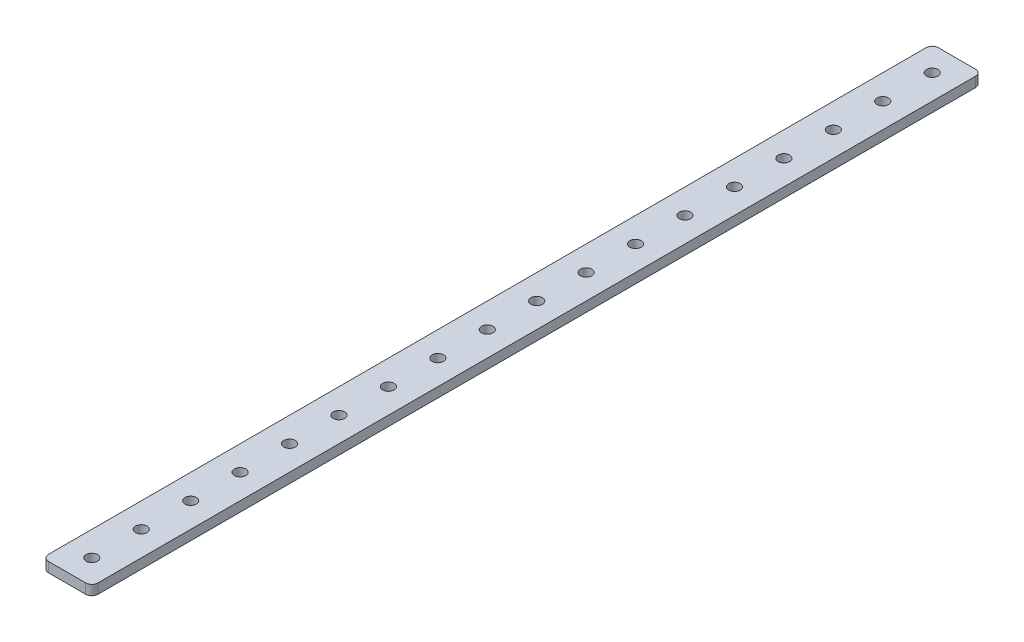
ISO-10303-21;
HEADER;
FILE_DESCRIPTION(('STEP AP214'),'2;1');
FILE_NAME('part.step','',(''),(''),'','','');
FILE_SCHEMA(('AUTOMOTIVE_DESIGN { 1 0 10303 214 1 1 1 1 }'));
ENDSEC;
DATA;
#1=APPLICATION_CONTEXT('core data for automotive mechanical design processes');
#2=APPLICATION_PROTOCOL_DEFINITION('international standard','automotive_design',2000,#1);
#3=PRODUCT_CONTEXT('',#1,'mechanical');
#4=PRODUCT('Part','Part','',(#3));
#5=PRODUCT_RELATED_PRODUCT_CATEGORY('part','',(#4));
#6=PRODUCT_DEFINITION_FORMATION('','',#4);
#7=PRODUCT_DEFINITION_CONTEXT('part definition',#1,'design');
#8=PRODUCT_DEFINITION('design','',#6,#7);
#9=PRODUCT_DEFINITION_SHAPE('','',#8);
#10=(LENGTH_UNIT() NAMED_UNIT(*) SI_UNIT(.MILLI.,.METRE.));
#11=(NAMED_UNIT(*) PLANE_ANGLE_UNIT() SI_UNIT($,.RADIAN.));
#12=(NAMED_UNIT(*) SI_UNIT($,.STERADIAN.) SOLID_ANGLE_UNIT());
#13=UNCERTAINTY_MEASURE_WITH_UNIT(LENGTH_MEASURE(1.E-05),#10,'distance_accuracy_value','');
#14=(GEOMETRIC_REPRESENTATION_CONTEXT(3) GLOBAL_UNCERTAINTY_ASSIGNED_CONTEXT((#13)) GLOBAL_UNIT_ASSIGNED_CONTEXT((#10,
#11,#12)) REPRESENTATION_CONTEXT('',''));
#15=CARTESIAN_POINT('',(0.,0.,0.));
#16=DIRECTION('',(0.,0.,1.));
#17=DIRECTION('',(1.,0.,0.));
#18=AXIS2_PLACEMENT_3D('',#15,#16,#17);
#19=CARTESIAN_POINT('',(6.,0.,-2.));
#20=DIRECTION('',(0.,1.,0.));
#21=DIRECTION('',(0.,0.,1.));
#22=AXIS2_PLACEMENT_3D('',#19,#20,#21);
#23=CYLINDRICAL_SURFACE('',#22,2.);
#24=CARTESIAN_POINT('',(6.,3.2,-2.));
#25=DIRECTION('',(0.,1.,0.));
#26=DIRECTION('',(0.,0.,1.));
#27=AXIS2_PLACEMENT_3D('',#24,#25,#26);
#28=CIRCLE('',#27,2.);
#29=CARTESIAN_POINT('',(6.,3.2,0.));
#30=VERTEX_POINT('',#29);
#31=CARTESIAN_POINT('',(8.,3.2,-2.));
#32=VERTEX_POINT('',#31);
#33=EDGE_CURVE('E129',#30,#32,#28,.T.);
#34=ORIENTED_EDGE('',*,*,#33,.F.);
#35=DIRECTION('',(0.,1.,0.));
#36=VECTOR('',#35,1.);
#37=CARTESIAN_POINT('',(6.,0.,0.));
#38=LINE('',#37,#36);
#39=CARTESIAN_POINT('',(6.,0.,0.));
#40=VERTEX_POINT('',#39);
#41=EDGE_CURVE('E11',#40,#30,#38,.T.);
#42=ORIENTED_EDGE('',*,*,#41,.F.);
#43=CARTESIAN_POINT('',(6.,0.,-2.));
#44=DIRECTION('',(0.,1.,0.));
#45=DIRECTION('',(0.,0.,1.));
#46=AXIS2_PLACEMENT_3D('',#43,#44,#45);
#47=CIRCLE('',#46,2.);
#48=CARTESIAN_POINT('',(8.,0.,-2.));
#49=VERTEX_POINT('',#48);
#50=EDGE_CURVE('E150',#40,#49,#47,.T.);
#51=ORIENTED_EDGE('',*,*,#50,.T.);
#52=DIRECTION('',(0.,1.,0.));
#53=VECTOR('',#52,1.);
#54=CARTESIAN_POINT('',(8.,0.,-2.));
#55=LINE('',#54,#53);
#56=EDGE_CURVE('E35',#49,#32,#55,.T.);
#57=ORIENTED_EDGE('',*,*,#56,.T.);
#58=EDGE_LOOP('',(#34,#42,#51,#57));
#59=FACE_BOUND('',#58,.T.);
#60=ADVANCED_FACE('F32',(#59),#23,.T.);
#61=CARTESIAN_POINT('',(-6.,0.,0.));
#62=DIRECTION('',(0.,0.,1.));
#63=DIRECTION('',(1.,0.,0.));
#64=AXIS2_PLACEMENT_3D('',#61,#62,#63);
#65=PLANE('',#64);
#66=DIRECTION('',(1.,0.,0.));
#67=VECTOR('',#66,1.);
#68=CARTESIAN_POINT('',(-6.,3.2,0.));
#69=LINE('',#68,#67);
#70=CARTESIAN_POINT('',(-6.,3.2,0.));
#71=VERTEX_POINT('',#70);
#72=EDGE_CURVE('E148',#71,#30,#69,.T.);
#73=ORIENTED_EDGE('',*,*,#72,.F.);
#74=DIRECTION('',(0.,1.,0.));
#75=VECTOR('',#74,1.);
#76=CARTESIAN_POINT('',(-6.,0.,0.));
#77=LINE('',#76,#75);
#78=CARTESIAN_POINT('',(-6.,0.,0.));
#79=VERTEX_POINT('',#78);
#80=EDGE_CURVE('E41',#79,#71,#77,.T.);
#81=ORIENTED_EDGE('',*,*,#80,.F.);
#82=DIRECTION('',(1.,0.,0.));
#83=VECTOR('',#82,1.);
#84=CARTESIAN_POINT('',(-6.,0.,0.));
#85=LINE('',#84,#83);
#86=EDGE_CURVE('E119',#79,#40,#85,.T.);
#87=ORIENTED_EDGE('',*,*,#86,.T.);
#88=ORIENTED_EDGE('',*,*,#41,.T.);
#89=EDGE_LOOP('',(#73,#81,#87,#88));
#90=FACE_BOUND('',#89,.T.);
#91=ADVANCED_FACE('F162',(#90),#65,.T.);
#92=CARTESIAN_POINT('',(-6.,0.,-2.));
#93=DIRECTION('',(0.,1.,0.));
#94=DIRECTION('',(0.,0.,1.));
#95=AXIS2_PLACEMENT_3D('',#92,#93,#94);
#96=CYLINDRICAL_SURFACE('',#95,2.);
#97=CARTESIAN_POINT('',(-6.,3.2,-2.));
#98=DIRECTION('',(0.,1.,0.));
#99=DIRECTION('',(0.,0.,1.));
#100=AXIS2_PLACEMENT_3D('',#97,#98,#99);
#101=CIRCLE('',#100,2.);
#102=CARTESIAN_POINT('',(-8.,3.2,-2.));
#103=VERTEX_POINT('',#102);
#104=EDGE_CURVE('E106',#103,#71,#101,.T.);
#105=ORIENTED_EDGE('',*,*,#104,.F.);
#106=DIRECTION('',(0.,1.,0.));
#107=VECTOR('',#106,1.);
#108=CARTESIAN_POINT('',(-8.,0.,-2.));
#109=LINE('',#108,#107);
#110=CARTESIAN_POINT('',(-8.,0.,-2.));
#111=VERTEX_POINT('',#110);
#112=EDGE_CURVE('E101',#111,#103,#109,.T.);
#113=ORIENTED_EDGE('',*,*,#112,.F.);
#114=CARTESIAN_POINT('',(-6.,0.,-2.));
#115=DIRECTION('',(0.,1.,0.));
#116=DIRECTION('',(0.,0.,1.));
#117=AXIS2_PLACEMENT_3D('',#114,#115,#116);
#118=CIRCLE('',#117,2.);
#119=EDGE_CURVE('E104',#111,#79,#118,.T.);
#120=ORIENTED_EDGE('',*,*,#119,.T.);
#121=ORIENTED_EDGE('',*,*,#80,.T.);
#122=EDGE_LOOP('',(#105,#113,#120,#121));
#123=FACE_BOUND('',#122,.T.);
#124=ADVANCED_FACE('F103',(#123),#96,.T.);
#125=CARTESIAN_POINT('',(-8.,0.,-286.));
#126=DIRECTION('',(-1.,0.,0.));
#127=DIRECTION('',(0.,0.,1.));
#128=AXIS2_PLACEMENT_3D('',#125,#126,#127);
#129=PLANE('',#128);
#130=DIRECTION('',(0.,0.,1.));
#131=VECTOR('',#130,1.);
#132=CARTESIAN_POINT('',(-8.,3.2,-286.));
#133=LINE('',#132,#131);
#134=CARTESIAN_POINT('',(-8.,3.2,-286.));
#135=VERTEX_POINT('',#134);
#136=EDGE_CURVE('E145',#135,#103,#133,.T.);
#137=ORIENTED_EDGE('',*,*,#136,.F.);
#138=DIRECTION('',(0.,1.,0.));
#139=VECTOR('',#138,1.);
#140=CARTESIAN_POINT('',(-8.,0.,-286.));
#141=LINE('',#140,#139);
#142=CARTESIAN_POINT('',(-8.,0.,-286.));
#143=VERTEX_POINT('',#142);
#144=EDGE_CURVE('E111',#143,#135,#141,.T.);
#145=ORIENTED_EDGE('',*,*,#144,.F.);
#146=DIRECTION('',(0.,0.,1.));
#147=VECTOR('',#146,1.);
#148=CARTESIAN_POINT('',(-8.,0.,-286.));
#149=LINE('',#148,#147);
#150=EDGE_CURVE('E117',#143,#111,#149,.T.);
#151=ORIENTED_EDGE('',*,*,#150,.T.);
#152=ORIENTED_EDGE('',*,*,#112,.T.);
#153=EDGE_LOOP('',(#137,#145,#151,#152));
#154=FACE_BOUND('',#153,.T.);
#155=ADVANCED_FACE('F121',(#154),#129,.T.);
#156=CARTESIAN_POINT('',(-6.,0.,-286.));
#157=DIRECTION('',(0.,1.,0.));
#158=DIRECTION('',(0.,0.,1.));
#159=AXIS2_PLACEMENT_3D('',#156,#157,#158);
#160=CYLINDRICAL_SURFACE('',#159,2.);
#161=CARTESIAN_POINT('',(-6.,3.2,-286.));
#162=DIRECTION('',(0.,1.,0.));
#163=DIRECTION('',(0.,0.,1.));
#164=AXIS2_PLACEMENT_3D('',#161,#162,#163);
#165=CIRCLE('',#164,2.);
#166=CARTESIAN_POINT('',(-6.,3.2,-288.));
#167=VERTEX_POINT('',#166);
#168=EDGE_CURVE('E142',#167,#135,#165,.T.);
#169=ORIENTED_EDGE('',*,*,#168,.F.);
#170=DIRECTION('',(0.,1.,0.));
#171=VECTOR('',#170,1.);
#172=CARTESIAN_POINT('',(-6.,0.,-288.));
#173=LINE('',#172,#171);
#174=CARTESIAN_POINT('',(-6.,0.,-288.));
#175=VERTEX_POINT('',#174);
#176=EDGE_CURVE('E154',#175,#167,#173,.T.);
#177=ORIENTED_EDGE('',*,*,#176,.F.);
#178=CARTESIAN_POINT('',(-6.,0.,-286.));
#179=DIRECTION('',(0.,1.,0.));
#180=DIRECTION('',(0.,0.,1.));
#181=AXIS2_PLACEMENT_3D('',#178,#179,#180);
#182=CIRCLE('',#181,2.);
#183=EDGE_CURVE('E122',#175,#143,#182,.T.);
#184=ORIENTED_EDGE('',*,*,#183,.T.);
#185=ORIENTED_EDGE('',*,*,#144,.T.);
#186=EDGE_LOOP('',(#169,#177,#184,#185));
#187=FACE_BOUND('',#186,.T.);
#188=ADVANCED_FACE('F175',(#187),#160,.T.);
#189=CARTESIAN_POINT('',(6.,0.,-288.));
#190=DIRECTION('',(0.,0.,-1.));
#191=DIRECTION('',(-1.,0.,0.));
#192=AXIS2_PLACEMENT_3D('',#189,#190,#191);
#193=PLANE('',#192);
#194=DIRECTION('',(-1.,0.,0.));
#195=VECTOR('',#194,1.);
#196=CARTESIAN_POINT('',(6.,3.2,-288.));
#197=LINE('',#196,#195);
#198=CARTESIAN_POINT('',(6.,3.2,-288.));
#199=VERTEX_POINT('',#198);
#200=EDGE_CURVE('E139',#199,#167,#197,.T.);
#201=ORIENTED_EDGE('',*,*,#200,.F.);
#202=DIRECTION('',(0.,1.,0.));
#203=VECTOR('',#202,1.);
#204=CARTESIAN_POINT('',(6.,0.,-288.));
#205=LINE('',#204,#203);
#206=CARTESIAN_POINT('',(6.,0.,-288.));
#207=VERTEX_POINT('',#206);
#208=EDGE_CURVE('E156',#207,#199,#205,.T.);
#209=ORIENTED_EDGE('',*,*,#208,.F.);
#210=DIRECTION('',(-1.,0.,0.));
#211=VECTOR('',#210,1.);
#212=CARTESIAN_POINT('',(6.,0.,-288.));
#213=LINE('',#212,#211);
#214=EDGE_CURVE('E124',#207,#175,#213,.T.);
#215=ORIENTED_EDGE('',*,*,#214,.T.);
#216=ORIENTED_EDGE('',*,*,#176,.T.);
#217=EDGE_LOOP('',(#201,#209,#215,#216));
#218=FACE_BOUND('',#217,.T.);
#219=ADVANCED_FACE('F178',(#218),#193,.T.);
#220=CARTESIAN_POINT('',(6.,0.,-286.));
#221=DIRECTION('',(0.,1.,0.));
#222=DIRECTION('',(0.,0.,1.));
#223=AXIS2_PLACEMENT_3D('',#220,#221,#222);
#224=CYLINDRICAL_SURFACE('',#223,2.);
#225=CARTESIAN_POINT('',(6.,3.2,-286.));
#226=DIRECTION('',(0.,1.,0.));
#227=DIRECTION('',(0.,0.,1.));
#228=AXIS2_PLACEMENT_3D('',#225,#226,#227);
#229=CIRCLE('',#228,2.);
#230=CARTESIAN_POINT('',(8.,3.2,-286.));
#231=VERTEX_POINT('',#230);
#232=EDGE_CURVE('E136',#231,#199,#229,.T.);
#233=ORIENTED_EDGE('',*,*,#232,.F.);
#234=DIRECTION('',(0.,1.,0.));
#235=VECTOR('',#234,1.);
#236=CARTESIAN_POINT('',(8.,0.,-286.));
#237=LINE('',#236,#235);
#238=CARTESIAN_POINT('',(8.,0.,-286.));
#239=VERTEX_POINT('',#238);
#240=EDGE_CURVE('E157',#239,#231,#237,.T.);
#241=ORIENTED_EDGE('',*,*,#240,.F.);
#242=CARTESIAN_POINT('',(6.,0.,-286.));
#243=DIRECTION('',(0.,1.,0.));
#244=DIRECTION('',(0.,0.,1.));
#245=AXIS2_PLACEMENT_3D('',#242,#243,#244);
#246=CIRCLE('',#245,2.);
#247=EDGE_CURVE('E384',#239,#207,#246,.T.);
#248=ORIENTED_EDGE('',*,*,#247,.T.);
#249=ORIENTED_EDGE('',*,*,#208,.T.);
#250=EDGE_LOOP('',(#233,#241,#248,#249));
#251=FACE_BOUND('',#250,.T.);
#252=ADVANCED_FACE('F182',(#251),#224,.T.);
#253=CARTESIAN_POINT('',(8.,0.,-2.));
#254=DIRECTION('',(1.,0.,0.));
#255=DIRECTION('',(0.,0.,-1.));
#256=AXIS2_PLACEMENT_3D('',#253,#254,#255);
#257=PLANE('',#256);
#258=DIRECTION('',(0.,0.,-1.));
#259=VECTOR('',#258,1.);
#260=CARTESIAN_POINT('',(8.,3.2,-2.));
#261=LINE('',#260,#259);
#262=EDGE_CURVE('E132',#32,#231,#261,.T.);
#263=ORIENTED_EDGE('',*,*,#262,.F.);
#264=ORIENTED_EDGE('',*,*,#56,.F.);
#265=DIRECTION('',(0.,0.,-1.));
#266=VECTOR('',#265,1.);
#267=CARTESIAN_POINT('',(8.,0.,-2.));
#268=LINE('',#267,#266);
#269=EDGE_CURVE('E382',#49,#239,#268,.T.);
#270=ORIENTED_EDGE('',*,*,#269,.T.);
#271=ORIENTED_EDGE('',*,*,#240,.T.);
#272=EDGE_LOOP('',(#263,#264,#270,#271));
#273=FACE_BOUND('',#272,.T.);
#274=ADVANCED_FACE('F159',(#273),#257,.T.);
#275=CARTESIAN_POINT('',(6.,0.,-2.));
#276=DIRECTION('',(0.,1.,0.));
#277=DIRECTION('',(0.,0.,1.));
#278=AXIS2_PLACEMENT_3D('',#275,#276,#277);
#279=PLANE('',#278);
#280=CARTESIAN_POINT('',(0.,0.,-8.));
#281=DIRECTION('',(0.,1.,0.));
#282=DIRECTION('',(0.,0.,-1.));
#283=AXIS2_PLACEMENT_3D('',#280,#281,#282);
#284=CIRCLE('',#283,1.85);
#285=CARTESIAN_POINT('',(0.,0.,-9.85));
#286=VERTEX_POINT('',#285);
#287=EDGE_CURVE('E273',#286,#286,#284,.T.);
#288=ORIENTED_EDGE('',*,*,#287,.T.);
#289=EDGE_LOOP('',(#288));
#290=FACE_BOUND('',#289,.T.);
#291=CARTESIAN_POINT('',(0.,0.,-24.));
#292=DIRECTION('',(0.,1.,0.));
#293=DIRECTION('',(0.,0.,-1.));
#294=AXIS2_PLACEMENT_3D('',#291,#292,#293);
#295=CIRCLE('',#294,1.85);
#296=CARTESIAN_POINT('',(0.,0.,-25.85));
#297=VERTEX_POINT('',#296);
#298=EDGE_CURVE('E281',#297,#297,#295,.T.);
#299=ORIENTED_EDGE('',*,*,#298,.T.);
#300=EDGE_LOOP('',(#299));
#301=FACE_BOUND('',#300,.T.);
#302=CARTESIAN_POINT('',(0.,0.,-40.));
#303=DIRECTION('',(0.,1.,0.));
#304=DIRECTION('',(0.,0.,-1.));
#305=AXIS2_PLACEMENT_3D('',#302,#303,#304);
#306=CIRCLE('',#305,1.85);
#307=CARTESIAN_POINT('',(0.,0.,-41.85));
#308=VERTEX_POINT('',#307);
#309=EDGE_CURVE('E287',#308,#308,#306,.T.);
#310=ORIENTED_EDGE('',*,*,#309,.T.);
#311=EDGE_LOOP('',(#310));
#312=FACE_BOUND('',#311,.T.);
#313=CARTESIAN_POINT('',(0.,0.,-56.));
#314=DIRECTION('',(0.,1.,0.));
#315=DIRECTION('',(0.,0.,-1.));
#316=AXIS2_PLACEMENT_3D('',#313,#314,#315);
#317=CIRCLE('',#316,1.85);
#318=CARTESIAN_POINT('',(0.,0.,-57.85));
#319=VERTEX_POINT('',#318);
#320=EDGE_CURVE('E293',#319,#319,#317,.T.);
#321=ORIENTED_EDGE('',*,*,#320,.T.);
#322=EDGE_LOOP('',(#321));
#323=FACE_BOUND('',#322,.T.);
#324=CARTESIAN_POINT('',(0.,0.,-72.));
#325=DIRECTION('',(0.,1.,0.));
#326=DIRECTION('',(0.,0.,-1.));
#327=AXIS2_PLACEMENT_3D('',#324,#325,#326);
#328=CIRCLE('',#327,1.85);
#329=CARTESIAN_POINT('',(0.,0.,-73.85));
#330=VERTEX_POINT('',#329);
#331=EDGE_CURVE('E299',#330,#330,#328,.T.);
#332=ORIENTED_EDGE('',*,*,#331,.T.);
#333=EDGE_LOOP('',(#332));
#334=FACE_BOUND('',#333,.T.);
#335=CARTESIAN_POINT('',(0.,0.,-88.));
#336=DIRECTION('',(0.,1.,0.));
#337=DIRECTION('',(0.,0.,-1.));
#338=AXIS2_PLACEMENT_3D('',#335,#336,#337);
#339=CIRCLE('',#338,1.85);
#340=CARTESIAN_POINT('',(0.,0.,-89.85));
#341=VERTEX_POINT('',#340);
#342=EDGE_CURVE('E305',#341,#341,#339,.T.);
#343=ORIENTED_EDGE('',*,*,#342,.T.);
#344=EDGE_LOOP('',(#343));
#345=FACE_BOUND('',#344,.T.);
#346=CARTESIAN_POINT('',(0.,0.,-104.));
#347=DIRECTION('',(0.,1.,0.));
#348=DIRECTION('',(0.,0.,-1.));
#349=AXIS2_PLACEMENT_3D('',#346,#347,#348);
#350=CIRCLE('',#349,1.85);
#351=CARTESIAN_POINT('',(0.,0.,-105.85));
#352=VERTEX_POINT('',#351);
#353=EDGE_CURVE('E311',#352,#352,#350,.T.);
#354=ORIENTED_EDGE('',*,*,#353,.T.);
#355=EDGE_LOOP('',(#354));
#356=FACE_BOUND('',#355,.T.);
#357=CARTESIAN_POINT('',(0.,0.,-120.));
#358=DIRECTION('',(0.,1.,0.));
#359=DIRECTION('',(0.,0.,-1.));
#360=AXIS2_PLACEMENT_3D('',#357,#358,#359);
#361=CIRCLE('',#360,1.85);
#362=CARTESIAN_POINT('',(0.,0.,-121.85));
#363=VERTEX_POINT('',#362);
#364=EDGE_CURVE('E317',#363,#363,#361,.T.);
#365=ORIENTED_EDGE('',*,*,#364,.T.);
#366=EDGE_LOOP('',(#365));
#367=FACE_BOUND('',#366,.T.);
#368=CARTESIAN_POINT('',(0.,0.,-136.));
#369=DIRECTION('',(0.,1.,0.));
#370=DIRECTION('',(0.,0.,-1.));
#371=AXIS2_PLACEMENT_3D('',#368,#369,#370);
#372=CIRCLE('',#371,1.84999999999999);
#373=CARTESIAN_POINT('',(0.,0.,-137.85));
#374=VERTEX_POINT('',#373);
#375=EDGE_CURVE('E323',#374,#374,#372,.T.);
#376=ORIENTED_EDGE('',*,*,#375,.T.);
#377=EDGE_LOOP('',(#376));
#378=FACE_BOUND('',#377,.T.);
#379=CARTESIAN_POINT('',(0.,0.,-152.));
#380=DIRECTION('',(0.,1.,0.));
#381=DIRECTION('',(0.,0.,-1.));
#382=AXIS2_PLACEMENT_3D('',#379,#380,#381);
#383=CIRCLE('',#382,1.84999999999999);
#384=CARTESIAN_POINT('',(0.,0.,-153.85));
#385=VERTEX_POINT('',#384);
#386=EDGE_CURVE('E329',#385,#385,#383,.T.);
#387=ORIENTED_EDGE('',*,*,#386,.T.);
#388=EDGE_LOOP('',(#387));
#389=FACE_BOUND('',#388,.T.);
#390=CARTESIAN_POINT('',(0.,0.,-168.));
#391=DIRECTION('',(0.,1.,0.));
#392=DIRECTION('',(0.,0.,-1.));
#393=AXIS2_PLACEMENT_3D('',#390,#391,#392);
#394=CIRCLE('',#393,1.84999999999999);
#395=CARTESIAN_POINT('',(0.,0.,-169.85));
#396=VERTEX_POINT('',#395);
#397=EDGE_CURVE('E335',#396,#396,#394,.T.);
#398=ORIENTED_EDGE('',*,*,#397,.T.);
#399=EDGE_LOOP('',(#398));
#400=FACE_BOUND('',#399,.T.);
#401=CARTESIAN_POINT('',(0.,0.,-184.));
#402=DIRECTION('',(0.,1.,0.));
#403=DIRECTION('',(0.,0.,-1.));
#404=AXIS2_PLACEMENT_3D('',#401,#402,#403);
#405=CIRCLE('',#404,1.84999999999999);
#406=CARTESIAN_POINT('',(0.,0.,-185.85));
#407=VERTEX_POINT('',#406);
#408=EDGE_CURVE('E341',#407,#407,#405,.T.);
#409=ORIENTED_EDGE('',*,*,#408,.T.);
#410=EDGE_LOOP('',(#409));
#411=FACE_BOUND('',#410,.T.);
#412=CARTESIAN_POINT('',(0.,0.,-200.));
#413=DIRECTION('',(0.,1.,0.));
#414=DIRECTION('',(0.,0.,-1.));
#415=AXIS2_PLACEMENT_3D('',#412,#413,#414);
#416=CIRCLE('',#415,1.84999999999999);
#417=CARTESIAN_POINT('',(0.,0.,-201.85));
#418=VERTEX_POINT('',#417);
#419=EDGE_CURVE('E347',#418,#418,#416,.T.);
#420=ORIENTED_EDGE('',*,*,#419,.T.);
#421=EDGE_LOOP('',(#420));
#422=FACE_BOUND('',#421,.T.);
#423=CARTESIAN_POINT('',(0.,0.,-216.));
#424=DIRECTION('',(0.,1.,0.));
#425=DIRECTION('',(0.,0.,-1.));
#426=AXIS2_PLACEMENT_3D('',#423,#424,#425);
#427=CIRCLE('',#426,1.84999999999999);
#428=CARTESIAN_POINT('',(0.,0.,-217.85));
#429=VERTEX_POINT('',#428);
#430=EDGE_CURVE('E353',#429,#429,#427,.T.);
#431=ORIENTED_EDGE('',*,*,#430,.T.);
#432=EDGE_LOOP('',(#431));
#433=FACE_BOUND('',#432,.T.);
#434=CARTESIAN_POINT('',(0.,0.,-232.));
#435=DIRECTION('',(0.,1.,0.));
#436=DIRECTION('',(0.,0.,-1.));
#437=AXIS2_PLACEMENT_3D('',#434,#435,#436);
#438=CIRCLE('',#437,1.84999999999999);
#439=CARTESIAN_POINT('',(0.,0.,-233.85));
#440=VERTEX_POINT('',#439);
#441=EDGE_CURVE('E359',#440,#440,#438,.T.);
#442=ORIENTED_EDGE('',*,*,#441,.T.);
#443=EDGE_LOOP('',(#442));
#444=FACE_BOUND('',#443,.T.);
#445=CARTESIAN_POINT('',(0.,0.,-248.));
#446=DIRECTION('',(0.,1.,0.));
#447=DIRECTION('',(0.,0.,-1.));
#448=AXIS2_PLACEMENT_3D('',#445,#446,#447);
#449=CIRCLE('',#448,1.84999999999999);
#450=CARTESIAN_POINT('',(0.,0.,-249.85));
#451=VERTEX_POINT('',#450);
#452=EDGE_CURVE('E365',#451,#451,#449,.T.);
#453=ORIENTED_EDGE('',*,*,#452,.T.);
#454=EDGE_LOOP('',(#453));
#455=FACE_BOUND('',#454,.T.);
#456=CARTESIAN_POINT('',(0.,0.,-264.));
#457=DIRECTION('',(0.,1.,0.));
#458=DIRECTION('',(0.,0.,-1.));
#459=AXIS2_PLACEMENT_3D('',#456,#457,#458);
#460=CIRCLE('',#459,1.85000000000002);
#461=CARTESIAN_POINT('',(0.,0.,-265.85));
#462=VERTEX_POINT('',#461);
#463=EDGE_CURVE('E371',#462,#462,#460,.T.);
#464=ORIENTED_EDGE('',*,*,#463,.T.);
#465=EDGE_LOOP('',(#464));
#466=FACE_BOUND('',#465,.T.);
#467=CARTESIAN_POINT('',(0.,0.,-280.));
#468=DIRECTION('',(0.,1.,0.));
#469=DIRECTION('',(0.,0.,-1.));
#470=AXIS2_PLACEMENT_3D('',#467,#468,#469);
#471=CIRCLE('',#470,1.85000000000002);
#472=CARTESIAN_POINT('',(0.,0.,-281.85));
#473=VERTEX_POINT('',#472);
#474=EDGE_CURVE('E133',#473,#473,#471,.T.);
#475=ORIENTED_EDGE('',*,*,#474,.T.);
#476=EDGE_LOOP('',(#475));
#477=FACE_BOUND('',#476,.T.);
#478=ORIENTED_EDGE('',*,*,#50,.F.);
#479=ORIENTED_EDGE('',*,*,#86,.F.);
#480=ORIENTED_EDGE('',*,*,#119,.F.);
#481=ORIENTED_EDGE('',*,*,#150,.F.);
#482=ORIENTED_EDGE('',*,*,#183,.F.);
#483=ORIENTED_EDGE('',*,*,#214,.F.);
#484=ORIENTED_EDGE('',*,*,#247,.F.);
#485=ORIENTED_EDGE('',*,*,#269,.F.);
#486=EDGE_LOOP('',(#478,#479,#480,#481,#482,#483,#484,#485));
#487=FACE_BOUND('',#486,.T.);
#488=ADVANCED_FACE('F115',(#290,#301,#312,#323,#334,#345,#356,#367,#378,#389,#400,#411,#422,
#433,#444,#455,#466,#477,#487),#279,.F.);
#489=CARTESIAN_POINT('',(6.,3.2,-2.));
#490=DIRECTION('',(0.,1.,0.));
#491=DIRECTION('',(0.,0.,1.));
#492=AXIS2_PLACEMENT_3D('',#489,#490,#491);
#493=PLANE('',#492);
#494=CARTESIAN_POINT('',(0.,3.2,-8.));
#495=DIRECTION('',(0.,1.,0.));
#496=DIRECTION('',(0.,0.,-1.));
#497=AXIS2_PLACEMENT_3D('',#494,#495,#496);
#498=CIRCLE('',#497,1.85);
#499=CARTESIAN_POINT('',(0.,3.2,-9.85));
#500=VERTEX_POINT('',#499);
#501=EDGE_CURVE('E276',#500,#500,#498,.T.);
#502=ORIENTED_EDGE('',*,*,#501,.F.);
#503=EDGE_LOOP('',(#502));
#504=FACE_BOUND('',#503,.T.);
#505=CARTESIAN_POINT('',(0.,3.2,-24.));
#506=DIRECTION('',(0.,1.,0.));
#507=DIRECTION('',(0.,0.,-1.));
#508=AXIS2_PLACEMENT_3D('',#505,#506,#507);
#509=CIRCLE('',#508,1.85);
#510=CARTESIAN_POINT('',(0.,3.2,-25.85));
#511=VERTEX_POINT('',#510);
#512=EDGE_CURVE('E278',#511,#511,#509,.T.);
#513=ORIENTED_EDGE('',*,*,#512,.F.);
#514=EDGE_LOOP('',(#513));
#515=FACE_BOUND('',#514,.T.);
#516=CARTESIAN_POINT('',(0.,3.2,-40.));
#517=DIRECTION('',(0.,1.,0.));
#518=DIRECTION('',(0.,0.,-1.));
#519=AXIS2_PLACEMENT_3D('',#516,#517,#518);
#520=CIRCLE('',#519,1.85);
#521=CARTESIAN_POINT('',(0.,3.2,-41.85));
#522=VERTEX_POINT('',#521);
#523=EDGE_CURVE('E284',#522,#522,#520,.T.);
#524=ORIENTED_EDGE('',*,*,#523,.F.);
#525=EDGE_LOOP('',(#524));
#526=FACE_BOUND('',#525,.T.);
#527=CARTESIAN_POINT('',(0.,3.2,-56.));
#528=DIRECTION('',(0.,1.,0.));
#529=DIRECTION('',(0.,0.,-1.));
#530=AXIS2_PLACEMENT_3D('',#527,#528,#529);
#531=CIRCLE('',#530,1.85);
#532=CARTESIAN_POINT('',(0.,3.2,-57.85));
#533=VERTEX_POINT('',#532);
#534=EDGE_CURVE('E290',#533,#533,#531,.T.);
#535=ORIENTED_EDGE('',*,*,#534,.F.);
#536=EDGE_LOOP('',(#535));
#537=FACE_BOUND('',#536,.T.);
#538=CARTESIAN_POINT('',(0.,3.2,-72.));
#539=DIRECTION('',(0.,1.,0.));
#540=DIRECTION('',(0.,0.,-1.));
#541=AXIS2_PLACEMENT_3D('',#538,#539,#540);
#542=CIRCLE('',#541,1.85);
#543=CARTESIAN_POINT('',(0.,3.2,-73.85));
#544=VERTEX_POINT('',#543);
#545=EDGE_CURVE('E296',#544,#544,#542,.T.);
#546=ORIENTED_EDGE('',*,*,#545,.F.);
#547=EDGE_LOOP('',(#546));
#548=FACE_BOUND('',#547,.T.);
#549=CARTESIAN_POINT('',(0.,3.2,-88.));
#550=DIRECTION('',(0.,1.,0.));
#551=DIRECTION('',(0.,0.,-1.));
#552=AXIS2_PLACEMENT_3D('',#549,#550,#551);
#553=CIRCLE('',#552,1.85);
#554=CARTESIAN_POINT('',(0.,3.2,-89.85));
#555=VERTEX_POINT('',#554);
#556=EDGE_CURVE('E302',#555,#555,#553,.T.);
#557=ORIENTED_EDGE('',*,*,#556,.F.);
#558=EDGE_LOOP('',(#557));
#559=FACE_BOUND('',#558,.T.);
#560=CARTESIAN_POINT('',(0.,3.2,-104.));
#561=DIRECTION('',(0.,1.,0.));
#562=DIRECTION('',(0.,0.,-1.));
#563=AXIS2_PLACEMENT_3D('',#560,#561,#562);
#564=CIRCLE('',#563,1.85);
#565=CARTESIAN_POINT('',(0.,3.2,-105.85));
#566=VERTEX_POINT('',#565);
#567=EDGE_CURVE('E308',#566,#566,#564,.T.);
#568=ORIENTED_EDGE('',*,*,#567,.F.);
#569=EDGE_LOOP('',(#568));
#570=FACE_BOUND('',#569,.T.);
#571=CARTESIAN_POINT('',(0.,3.2,-120.));
#572=DIRECTION('',(0.,1.,0.));
#573=DIRECTION('',(0.,0.,-1.));
#574=AXIS2_PLACEMENT_3D('',#571,#572,#573);
#575=CIRCLE('',#574,1.85);
#576=CARTESIAN_POINT('',(0.,3.2,-121.85));
#577=VERTEX_POINT('',#576);
#578=EDGE_CURVE('E314',#577,#577,#575,.T.);
#579=ORIENTED_EDGE('',*,*,#578,.F.);
#580=EDGE_LOOP('',(#579));
#581=FACE_BOUND('',#580,.T.);
#582=CARTESIAN_POINT('',(0.,3.2,-136.));
#583=DIRECTION('',(0.,1.,0.));
#584=DIRECTION('',(0.,0.,-1.));
#585=AXIS2_PLACEMENT_3D('',#582,#583,#584);
#586=CIRCLE('',#585,1.84999999999999);
#587=CARTESIAN_POINT('',(0.,3.2,-137.85));
#588=VERTEX_POINT('',#587);
#589=EDGE_CURVE('E320',#588,#588,#586,.T.);
#590=ORIENTED_EDGE('',*,*,#589,.F.);
#591=EDGE_LOOP('',(#590));
#592=FACE_BOUND('',#591,.T.);
#593=CARTESIAN_POINT('',(0.,3.2,-152.));
#594=DIRECTION('',(0.,1.,0.));
#595=DIRECTION('',(0.,0.,-1.));
#596=AXIS2_PLACEMENT_3D('',#593,#594,#595);
#597=CIRCLE('',#596,1.84999999999999);
#598=CARTESIAN_POINT('',(0.,3.2,-153.85));
#599=VERTEX_POINT('',#598);
#600=EDGE_CURVE('E326',#599,#599,#597,.T.);
#601=ORIENTED_EDGE('',*,*,#600,.F.);
#602=EDGE_LOOP('',(#601));
#603=FACE_BOUND('',#602,.T.);
#604=CARTESIAN_POINT('',(0.,3.2,-168.));
#605=DIRECTION('',(0.,1.,0.));
#606=DIRECTION('',(0.,0.,-1.));
#607=AXIS2_PLACEMENT_3D('',#604,#605,#606);
#608=CIRCLE('',#607,1.84999999999999);
#609=CARTESIAN_POINT('',(0.,3.2,-169.85));
#610=VERTEX_POINT('',#609);
#611=EDGE_CURVE('E332',#610,#610,#608,.T.);
#612=ORIENTED_EDGE('',*,*,#611,.F.);
#613=EDGE_LOOP('',(#612));
#614=FACE_BOUND('',#613,.T.);
#615=CARTESIAN_POINT('',(0.,3.2,-184.));
#616=DIRECTION('',(0.,1.,0.));
#617=DIRECTION('',(0.,0.,-1.));
#618=AXIS2_PLACEMENT_3D('',#615,#616,#617);
#619=CIRCLE('',#618,1.84999999999999);
#620=CARTESIAN_POINT('',(0.,3.2,-185.85));
#621=VERTEX_POINT('',#620);
#622=EDGE_CURVE('E338',#621,#621,#619,.T.);
#623=ORIENTED_EDGE('',*,*,#622,.F.);
#624=EDGE_LOOP('',(#623));
#625=FACE_BOUND('',#624,.T.);
#626=CARTESIAN_POINT('',(0.,3.2,-200.));
#627=DIRECTION('',(0.,1.,0.));
#628=DIRECTION('',(0.,0.,-1.));
#629=AXIS2_PLACEMENT_3D('',#626,#627,#628);
#630=CIRCLE('',#629,1.84999999999999);
#631=CARTESIAN_POINT('',(0.,3.2,-201.85));
#632=VERTEX_POINT('',#631);
#633=EDGE_CURVE('E344',#632,#632,#630,.T.);
#634=ORIENTED_EDGE('',*,*,#633,.F.);
#635=EDGE_LOOP('',(#634));
#636=FACE_BOUND('',#635,.T.);
#637=CARTESIAN_POINT('',(0.,3.2,-216.));
#638=DIRECTION('',(0.,1.,0.));
#639=DIRECTION('',(0.,0.,-1.));
#640=AXIS2_PLACEMENT_3D('',#637,#638,#639);
#641=CIRCLE('',#640,1.84999999999999);
#642=CARTESIAN_POINT('',(0.,3.2,-217.85));
#643=VERTEX_POINT('',#642);
#644=EDGE_CURVE('E350',#643,#643,#641,.T.);
#645=ORIENTED_EDGE('',*,*,#644,.F.);
#646=EDGE_LOOP('',(#645));
#647=FACE_BOUND('',#646,.T.);
#648=CARTESIAN_POINT('',(0.,3.2,-232.));
#649=DIRECTION('',(0.,1.,0.));
#650=DIRECTION('',(0.,0.,-1.));
#651=AXIS2_PLACEMENT_3D('',#648,#649,#650);
#652=CIRCLE('',#651,1.84999999999999);
#653=CARTESIAN_POINT('',(0.,3.2,-233.85));
#654=VERTEX_POINT('',#653);
#655=EDGE_CURVE('E356',#654,#654,#652,.T.);
#656=ORIENTED_EDGE('',*,*,#655,.F.);
#657=EDGE_LOOP('',(#656));
#658=FACE_BOUND('',#657,.T.);
#659=CARTESIAN_POINT('',(0.,3.2,-248.));
#660=DIRECTION('',(0.,1.,0.));
#661=DIRECTION('',(0.,0.,-1.));
#662=AXIS2_PLACEMENT_3D('',#659,#660,#661);
#663=CIRCLE('',#662,1.84999999999999);
#664=CARTESIAN_POINT('',(0.,3.2,-249.85));
#665=VERTEX_POINT('',#664);
#666=EDGE_CURVE('E362',#665,#665,#663,.T.);
#667=ORIENTED_EDGE('',*,*,#666,.F.);
#668=EDGE_LOOP('',(#667));
#669=FACE_BOUND('',#668,.T.);
#670=CARTESIAN_POINT('',(0.,3.2,-264.));
#671=DIRECTION('',(0.,1.,0.));
#672=DIRECTION('',(0.,0.,-1.));
#673=AXIS2_PLACEMENT_3D('',#670,#671,#672);
#674=CIRCLE('',#673,1.85000000000002);
#675=CARTESIAN_POINT('',(0.,3.2,-265.85));
#676=VERTEX_POINT('',#675);
#677=EDGE_CURVE('E368',#676,#676,#674,.T.);
#678=ORIENTED_EDGE('',*,*,#677,.F.);
#679=EDGE_LOOP('',(#678));
#680=FACE_BOUND('',#679,.T.);
#681=CARTESIAN_POINT('',(0.,3.2,-280.));
#682=DIRECTION('',(0.,1.,0.));
#683=DIRECTION('',(0.,0.,-1.));
#684=AXIS2_PLACEMENT_3D('',#681,#682,#683);
#685=CIRCLE('',#684,1.85000000000002);
#686=CARTESIAN_POINT('',(0.,3.2,-281.85));
#687=VERTEX_POINT('',#686);
#688=EDGE_CURVE('E374',#687,#687,#685,.T.);
#689=ORIENTED_EDGE('',*,*,#688,.F.);
#690=EDGE_LOOP('',(#689));
#691=FACE_BOUND('',#690,.T.);
#692=ORIENTED_EDGE('',*,*,#33,.T.);
#693=ORIENTED_EDGE('',*,*,#262,.T.);
#694=ORIENTED_EDGE('',*,*,#232,.T.);
#695=ORIENTED_EDGE('',*,*,#200,.T.);
#696=ORIENTED_EDGE('',*,*,#168,.T.);
#697=ORIENTED_EDGE('',*,*,#136,.T.);
#698=ORIENTED_EDGE('',*,*,#104,.T.);
#699=ORIENTED_EDGE('',*,*,#72,.T.);
#700=EDGE_LOOP('',(#692,#693,#694,#695,#696,#697,#698,#699));
#701=FACE_BOUND('',#700,.T.);
#702=ADVANCED_FACE('F161',(#504,#515,#526,#537,#548,#559,#570,#581,#592,#603,#614,#625,#636,
#647,#658,#669,#680,#691,#701),#493,.T.);
#703=CARTESIAN_POINT('',(0.,0.,-280.));
#704=DIRECTION('',(0.,1.,0.));
#705=DIRECTION('',(0.,0.,1.));
#706=AXIS2_PLACEMENT_3D('',#703,#704,#705);
#707=CYLINDRICAL_SURFACE('',#706,1.85000000000002);
#708=ORIENTED_EDGE('',*,*,#474,.F.);
#709=EDGE_LOOP('',(#708));
#710=FACE_BOUND('',#709,.T.);
#711=ORIENTED_EDGE('',*,*,#688,.T.);
#712=EDGE_LOOP('',(#711));
#713=FACE_BOUND('',#712,.T.);
#714=ADVANCED_FACE('F194',(#710,#713),#707,.F.);
#715=CARTESIAN_POINT('',(0.,0.,-264.));
#716=DIRECTION('',(0.,1.,0.));
#717=DIRECTION('',(0.,0.,1.));
#718=AXIS2_PLACEMENT_3D('',#715,#716,#717);
#719=CYLINDRICAL_SURFACE('',#718,1.85000000000002);
#720=ORIENTED_EDGE('',*,*,#463,.F.);
#721=EDGE_LOOP('',(#720));
#722=FACE_BOUND('',#721,.T.);
#723=ORIENTED_EDGE('',*,*,#677,.T.);
#724=EDGE_LOOP('',(#723));
#725=FACE_BOUND('',#724,.T.);
#726=ADVANCED_FACE('F201',(#722,#725),#719,.F.);
#727=CARTESIAN_POINT('',(0.,0.,-248.));
#728=DIRECTION('',(0.,1.,0.));
#729=DIRECTION('',(0.,0.,1.));
#730=AXIS2_PLACEMENT_3D('',#727,#728,#729);
#731=CYLINDRICAL_SURFACE('',#730,1.84999999999999);
#732=ORIENTED_EDGE('',*,*,#452,.F.);
#733=EDGE_LOOP('',(#732));
#734=FACE_BOUND('',#733,.T.);
#735=ORIENTED_EDGE('',*,*,#666,.T.);
#736=EDGE_LOOP('',(#735));
#737=FACE_BOUND('',#736,.T.);
#738=ADVANCED_FACE('F205',(#734,#737),#731,.F.);
#739=CARTESIAN_POINT('',(0.,0.,-232.));
#740=DIRECTION('',(0.,1.,0.));
#741=DIRECTION('',(0.,0.,1.));
#742=AXIS2_PLACEMENT_3D('',#739,#740,#741);
#743=CYLINDRICAL_SURFACE('',#742,1.84999999999999);
#744=ORIENTED_EDGE('',*,*,#441,.F.);
#745=EDGE_LOOP('',(#744));
#746=FACE_BOUND('',#745,.T.);
#747=ORIENTED_EDGE('',*,*,#655,.T.);
#748=EDGE_LOOP('',(#747));
#749=FACE_BOUND('',#748,.T.);
#750=ADVANCED_FACE('F209',(#746,#749),#743,.F.);
#751=CARTESIAN_POINT('',(0.,0.,-216.));
#752=DIRECTION('',(0.,1.,0.));
#753=DIRECTION('',(0.,0.,1.));
#754=AXIS2_PLACEMENT_3D('',#751,#752,#753);
#755=CYLINDRICAL_SURFACE('',#754,1.84999999999999);
#756=ORIENTED_EDGE('',*,*,#430,.F.);
#757=EDGE_LOOP('',(#756));
#758=FACE_BOUND('',#757,.T.);
#759=ORIENTED_EDGE('',*,*,#644,.T.);
#760=EDGE_LOOP('',(#759));
#761=FACE_BOUND('',#760,.T.);
#762=ADVANCED_FACE('F213',(#758,#761),#755,.F.);
#763=CARTESIAN_POINT('',(0.,0.,-200.));
#764=DIRECTION('',(0.,1.,0.));
#765=DIRECTION('',(0.,0.,1.));
#766=AXIS2_PLACEMENT_3D('',#763,#764,#765);
#767=CYLINDRICAL_SURFACE('',#766,1.84999999999999);
#768=ORIENTED_EDGE('',*,*,#419,.F.);
#769=EDGE_LOOP('',(#768));
#770=FACE_BOUND('',#769,.T.);
#771=ORIENTED_EDGE('',*,*,#633,.T.);
#772=EDGE_LOOP('',(#771));
#773=FACE_BOUND('',#772,.T.);
#774=ADVANCED_FACE('F217',(#770,#773),#767,.F.);
#775=CARTESIAN_POINT('',(0.,0.,-184.));
#776=DIRECTION('',(0.,1.,0.));
#777=DIRECTION('',(0.,0.,1.));
#778=AXIS2_PLACEMENT_3D('',#775,#776,#777);
#779=CYLINDRICAL_SURFACE('',#778,1.84999999999999);
#780=ORIENTED_EDGE('',*,*,#408,.F.);
#781=EDGE_LOOP('',(#780));
#782=FACE_BOUND('',#781,.T.);
#783=ORIENTED_EDGE('',*,*,#622,.T.);
#784=EDGE_LOOP('',(#783));
#785=FACE_BOUND('',#784,.T.);
#786=ADVANCED_FACE('F221',(#782,#785),#779,.F.);
#787=CARTESIAN_POINT('',(0.,0.,-168.));
#788=DIRECTION('',(0.,1.,0.));
#789=DIRECTION('',(0.,0.,1.));
#790=AXIS2_PLACEMENT_3D('',#787,#788,#789);
#791=CYLINDRICAL_SURFACE('',#790,1.84999999999999);
#792=ORIENTED_EDGE('',*,*,#397,.F.);
#793=EDGE_LOOP('',(#792));
#794=FACE_BOUND('',#793,.T.);
#795=ORIENTED_EDGE('',*,*,#611,.T.);
#796=EDGE_LOOP('',(#795));
#797=FACE_BOUND('',#796,.T.);
#798=ADVANCED_FACE('F225',(#794,#797),#791,.F.);
#799=CARTESIAN_POINT('',(0.,0.,-152.));
#800=DIRECTION('',(0.,1.,0.));
#801=DIRECTION('',(0.,0.,1.));
#802=AXIS2_PLACEMENT_3D('',#799,#800,#801);
#803=CYLINDRICAL_SURFACE('',#802,1.84999999999999);
#804=ORIENTED_EDGE('',*,*,#386,.F.);
#805=EDGE_LOOP('',(#804));
#806=FACE_BOUND('',#805,.T.);
#807=ORIENTED_EDGE('',*,*,#600,.T.);
#808=EDGE_LOOP('',(#807));
#809=FACE_BOUND('',#808,.T.);
#810=ADVANCED_FACE('F229',(#806,#809),#803,.F.);
#811=CARTESIAN_POINT('',(0.,0.,-136.));
#812=DIRECTION('',(0.,1.,0.));
#813=DIRECTION('',(0.,0.,1.));
#814=AXIS2_PLACEMENT_3D('',#811,#812,#813);
#815=CYLINDRICAL_SURFACE('',#814,1.84999999999999);
#816=ORIENTED_EDGE('',*,*,#375,.F.);
#817=EDGE_LOOP('',(#816));
#818=FACE_BOUND('',#817,.T.);
#819=ORIENTED_EDGE('',*,*,#589,.T.);
#820=EDGE_LOOP('',(#819));
#821=FACE_BOUND('',#820,.T.);
#822=ADVANCED_FACE('F233',(#818,#821),#815,.F.);
#823=CARTESIAN_POINT('',(0.,0.,-120.));
#824=DIRECTION('',(0.,1.,0.));
#825=DIRECTION('',(0.,0.,1.));
#826=AXIS2_PLACEMENT_3D('',#823,#824,#825);
#827=CYLINDRICAL_SURFACE('',#826,1.85);
#828=ORIENTED_EDGE('',*,*,#364,.F.);
#829=EDGE_LOOP('',(#828));
#830=FACE_BOUND('',#829,.T.);
#831=ORIENTED_EDGE('',*,*,#578,.T.);
#832=EDGE_LOOP('',(#831));
#833=FACE_BOUND('',#832,.T.);
#834=ADVANCED_FACE('F237',(#830,#833),#827,.F.);
#835=CARTESIAN_POINT('',(0.,0.,-104.));
#836=DIRECTION('',(0.,1.,0.));
#837=DIRECTION('',(0.,0.,1.));
#838=AXIS2_PLACEMENT_3D('',#835,#836,#837);
#839=CYLINDRICAL_SURFACE('',#838,1.85);
#840=ORIENTED_EDGE('',*,*,#353,.F.);
#841=EDGE_LOOP('',(#840));
#842=FACE_BOUND('',#841,.T.);
#843=ORIENTED_EDGE('',*,*,#567,.T.);
#844=EDGE_LOOP('',(#843));
#845=FACE_BOUND('',#844,.T.);
#846=ADVANCED_FACE('F241',(#842,#845),#839,.F.);
#847=CARTESIAN_POINT('',(0.,0.,-88.));
#848=DIRECTION('',(0.,1.,0.));
#849=DIRECTION('',(0.,0.,1.));
#850=AXIS2_PLACEMENT_3D('',#847,#848,#849);
#851=CYLINDRICAL_SURFACE('',#850,1.85);
#852=ORIENTED_EDGE('',*,*,#342,.F.);
#853=EDGE_LOOP('',(#852));
#854=FACE_BOUND('',#853,.T.);
#855=ORIENTED_EDGE('',*,*,#556,.T.);
#856=EDGE_LOOP('',(#855));
#857=FACE_BOUND('',#856,.T.);
#858=ADVANCED_FACE('F245',(#854,#857),#851,.F.);
#859=CARTESIAN_POINT('',(0.,0.,-72.));
#860=DIRECTION('',(0.,1.,0.));
#861=DIRECTION('',(0.,0.,1.));
#862=AXIS2_PLACEMENT_3D('',#859,#860,#861);
#863=CYLINDRICAL_SURFACE('',#862,1.85);
#864=ORIENTED_EDGE('',*,*,#331,.F.);
#865=EDGE_LOOP('',(#864));
#866=FACE_BOUND('',#865,.T.);
#867=ORIENTED_EDGE('',*,*,#545,.T.);
#868=EDGE_LOOP('',(#867));
#869=FACE_BOUND('',#868,.T.);
#870=ADVANCED_FACE('F249',(#866,#869),#863,.F.);
#871=CARTESIAN_POINT('',(0.,0.,-56.));
#872=DIRECTION('',(0.,1.,0.));
#873=DIRECTION('',(0.,0.,1.));
#874=AXIS2_PLACEMENT_3D('',#871,#872,#873);
#875=CYLINDRICAL_SURFACE('',#874,1.85);
#876=ORIENTED_EDGE('',*,*,#320,.F.);
#877=EDGE_LOOP('',(#876));
#878=FACE_BOUND('',#877,.T.);
#879=ORIENTED_EDGE('',*,*,#534,.T.);
#880=EDGE_LOOP('',(#879));
#881=FACE_BOUND('',#880,.T.);
#882=ADVANCED_FACE('F253',(#878,#881),#875,.F.);
#883=CARTESIAN_POINT('',(0.,0.,-40.));
#884=DIRECTION('',(0.,1.,0.));
#885=DIRECTION('',(0.,0.,1.));
#886=AXIS2_PLACEMENT_3D('',#883,#884,#885);
#887=CYLINDRICAL_SURFACE('',#886,1.85);
#888=ORIENTED_EDGE('',*,*,#309,.F.);
#889=EDGE_LOOP('',(#888));
#890=FACE_BOUND('',#889,.T.);
#891=ORIENTED_EDGE('',*,*,#523,.T.);
#892=EDGE_LOOP('',(#891));
#893=FACE_BOUND('',#892,.T.);
#894=ADVANCED_FACE('F257',(#890,#893),#887,.F.);
#895=CARTESIAN_POINT('',(0.,0.,-24.));
#896=DIRECTION('',(0.,1.,0.));
#897=DIRECTION('',(0.,0.,1.));
#898=AXIS2_PLACEMENT_3D('',#895,#896,#897);
#899=CYLINDRICAL_SURFACE('',#898,1.85);
#900=ORIENTED_EDGE('',*,*,#298,.F.);
#901=EDGE_LOOP('',(#900));
#902=FACE_BOUND('',#901,.T.);
#903=ORIENTED_EDGE('',*,*,#512,.T.);
#904=EDGE_LOOP('',(#903));
#905=FACE_BOUND('',#904,.T.);
#906=ADVANCED_FACE('F261',(#902,#905),#899,.F.);
#907=CARTESIAN_POINT('',(0.,0.,-8.));
#908=DIRECTION('',(0.,1.,0.));
#909=DIRECTION('',(0.,0.,1.));
#910=AXIS2_PLACEMENT_3D('',#907,#908,#909);
#911=CYLINDRICAL_SURFACE('',#910,1.85);
#912=ORIENTED_EDGE('',*,*,#287,.F.);
#913=EDGE_LOOP('',(#912));
#914=FACE_BOUND('',#913,.T.);
#915=ORIENTED_EDGE('',*,*,#501,.T.);
#916=EDGE_LOOP('',(#915));
#917=FACE_BOUND('',#916,.T.);
#918=ADVANCED_FACE('F265',(#914,#917),#911,.F.);
#919=CLOSED_SHELL('',(#60,#91,#124,#155,#188,#219,#252,#274,#488,#702,#714,#726,#738,#750,#762,
#774,#786,#798,#810,#822,#834,#846,#858,#870,#882,#894,#906,#918));
#920=MANIFOLD_SOLID_BREP('B2',#919);
#921=ADVANCED_BREP_SHAPE_REPRESENTATION('',(#18,#920),#14);
#922=SHAPE_DEFINITION_REPRESENTATION(#9,#921);
ENDSEC;
END-ISO-10303-21;
